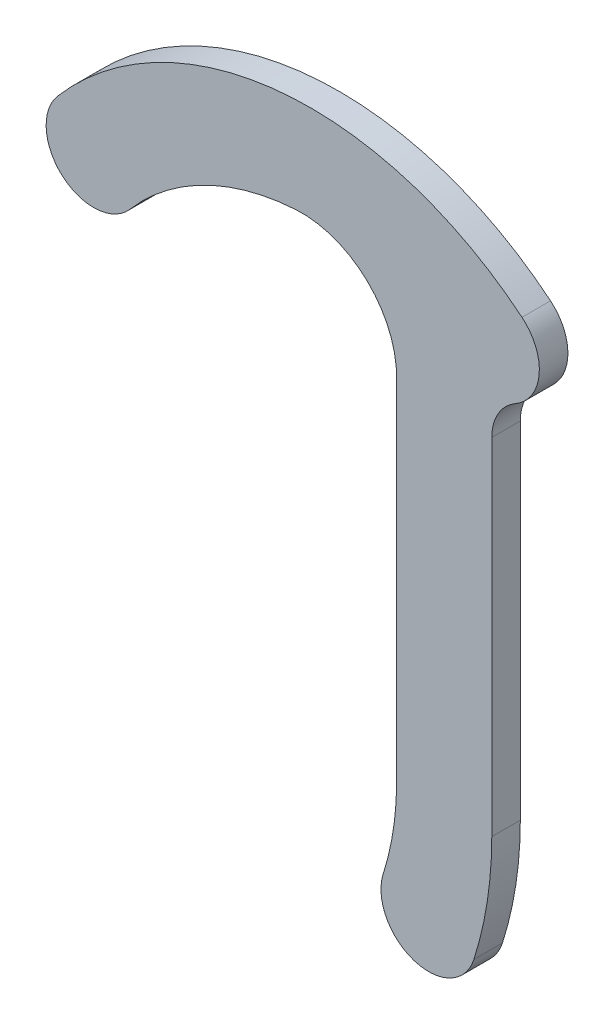
ISO-10303-21;
HEADER;
FILE_DESCRIPTION(('STEP AP214'),'2;1');
FILE_NAME('part.step','',(''),(''),'','','');
FILE_SCHEMA(('AUTOMOTIVE_DESIGN { 1 0 10303 214 1 1 1 1 }'));
ENDSEC;
DATA;
#1=APPLICATION_CONTEXT('core data for automotive mechanical design processes');
#2=APPLICATION_PROTOCOL_DEFINITION('international standard','automotive_design',2000,#1);
#3=PRODUCT_CONTEXT('',#1,'mechanical');
#4=PRODUCT('Part','Part','',(#3));
#5=PRODUCT_RELATED_PRODUCT_CATEGORY('part','',(#4));
#6=PRODUCT_DEFINITION_FORMATION('','',#4);
#7=PRODUCT_DEFINITION_CONTEXT('part definition',#1,'design');
#8=PRODUCT_DEFINITION('design','',#6,#7);
#9=PRODUCT_DEFINITION_SHAPE('','',#8);
#10=(LENGTH_UNIT() NAMED_UNIT(*) SI_UNIT(.MILLI.,.METRE.));
#11=(NAMED_UNIT(*) PLANE_ANGLE_UNIT() SI_UNIT($,.RADIAN.));
#12=(NAMED_UNIT(*) SI_UNIT($,.STERADIAN.) SOLID_ANGLE_UNIT());
#13=UNCERTAINTY_MEASURE_WITH_UNIT(LENGTH_MEASURE(1.E-05),#10,'distance_accuracy_value','');
#14=(GEOMETRIC_REPRESENTATION_CONTEXT(3) GLOBAL_UNCERTAINTY_ASSIGNED_CONTEXT((#13)) GLOBAL_UNIT_ASSIGNED_CONTEXT((#10,
#11,#12)) REPRESENTATION_CONTEXT('',''));
#15=CARTESIAN_POINT('',(0.,0.,0.));
#16=DIRECTION('',(0.,0.,1.));
#17=DIRECTION('',(1.,0.,0.));
#18=AXIS2_PLACEMENT_3D('',#15,#16,#17);
#19=CARTESIAN_POINT('',(-40.,-45.,1.5));
#20=DIRECTION('',(0.,0.,-1.));
#21=DIRECTION('',(-1.,0.,0.));
#22=AXIS2_PLACEMENT_3D('',#19,#20,#21);
#23=CYLINDRICAL_SURFACE('',#22,40.);
#24=CARTESIAN_POINT('',(-40.,-45.,-1.5));
#25=DIRECTION('',(0.,0.,1.));
#26=DIRECTION('',(-1.,0.,0.));
#27=AXIS2_PLACEMENT_3D('',#24,#25,#26);
#28=CIRCLE('',#27,40.);
#29=CARTESIAN_POINT('',(-1.88013713644046,-57.1192431803068,-1.5));
#30=VERTEX_POINT('',#29);
#31=CARTESIAN_POINT('',(0.,-44.9999999999999,-1.5));
#32=VERTEX_POINT('',#31);
#33=EDGE_CURVE('E211',#30,#32,#28,.T.);
#34=ORIENTED_EDGE('',*,*,#33,.T.);
#35=DIRECTION('',(0.,0.,-1.));
#36=VECTOR('',#35,1.);
#37=CARTESIAN_POINT('',(0.,-44.9999999999999,1.5));
#38=LINE('',#37,#36);
#39=CARTESIAN_POINT('',(0.,-44.9999999999999,1.5));
#40=VERTEX_POINT('',#39);
#41=EDGE_CURVE('E177',#40,#32,#38,.T.);
#42=ORIENTED_EDGE('',*,*,#41,.F.);
#43=CARTESIAN_POINT('',(-40.,-45.,1.5));
#44=DIRECTION('',(0.,0.,1.));
#45=DIRECTION('',(-1.,0.,0.));
#46=AXIS2_PLACEMENT_3D('',#43,#44,#45);
#47=CIRCLE('',#46,40.);
#48=CARTESIAN_POINT('',(-1.88013713644046,-57.1192431803068,1.5));
#49=VERTEX_POINT('',#48);
#50=EDGE_CURVE('E159',#49,#40,#47,.T.);
#51=ORIENTED_EDGE('',*,*,#50,.F.);
#52=DIRECTION('',(0.,0.,-1.));
#53=VECTOR('',#52,1.);
#54=CARTESIAN_POINT('',(-1.88013713644046,-57.1192431803068,1.5));
#55=LINE('',#54,#53);
#56=EDGE_CURVE('E160',#49,#30,#55,.T.);
#57=ORIENTED_EDGE('',*,*,#56,.T.);
#58=EDGE_LOOP('',(#34,#42,#51,#57));
#59=FACE_BOUND('',#58,.T.);
#60=ADVANCED_FACE('F32',(#59),#23,.T.);
#61=CARTESIAN_POINT('',(0.,-8.66025403784439,1.5));
#62=DIRECTION('',(-1.,0.,0.));
#63=DIRECTION('',(0.,-1.,0.));
#64=AXIS2_PLACEMENT_3D('',#61,#62,#63);
#65=PLANE('',#64);
#66=DIRECTION('',(0.,1.,0.));
#67=VECTOR('',#66,1.);
#68=CARTESIAN_POINT('',(0.,-8.66025403784439,-1.5));
#69=LINE('',#68,#67);
#70=CARTESIAN_POINT('',(0.,-8.66025403784439,-1.5));
#71=VERTEX_POINT('',#70);
#72=EDGE_CURVE('E150',#32,#71,#69,.T.);
#73=ORIENTED_EDGE('',*,*,#72,.T.);
#74=DIRECTION('',(0.,0.,-1.));
#75=VECTOR('',#74,1.);
#76=CARTESIAN_POINT('',(0.,-8.66025403784439,1.5));
#77=LINE('',#76,#75);
#78=CARTESIAN_POINT('',(0.,-8.66025403784439,1.5));
#79=VERTEX_POINT('',#78);
#80=EDGE_CURVE('E174',#79,#71,#77,.T.);
#81=ORIENTED_EDGE('',*,*,#80,.F.);
#82=DIRECTION('',(0.,1.,0.));
#83=VECTOR('',#82,1.);
#84=CARTESIAN_POINT('',(0.,-8.66025403784439,1.5));
#85=LINE('',#84,#83);
#86=EDGE_CURVE('E224',#40,#79,#85,.T.);
#87=ORIENTED_EDGE('',*,*,#86,.F.);
#88=ORIENTED_EDGE('',*,*,#41,.T.);
#89=EDGE_LOOP('',(#73,#81,#87,#88));
#90=FACE_BOUND('',#89,.T.);
#91=ADVANCED_FACE('F216',(#90),#65,.F.);
#92=CARTESIAN_POINT('',(5.,-8.66025403784439,1.5));
#93=DIRECTION('',(0.,0.,-1.));
#94=DIRECTION('',(-1.,0.,0.));
#95=AXIS2_PLACEMENT_3D('',#92,#93,#94);
#96=CYLINDRICAL_SURFACE('',#95,5.);
#97=CARTESIAN_POINT('',(5.,-8.66025403784439,-1.5));
#98=DIRECTION('',(0.,0.,-1.));
#99=DIRECTION('',(1.,0.,0.));
#100=AXIS2_PLACEMENT_3D('',#97,#98,#99);
#101=CIRCLE('',#100,5.);
#102=CARTESIAN_POINT('',(2.5,-4.33012701892219,-1.5));
#103=VERTEX_POINT('',#102);
#104=EDGE_CURVE('E146',#71,#103,#101,.T.);
#105=ORIENTED_EDGE('',*,*,#104,.T.);
#106=DIRECTION('',(0.,0.,-1.));
#107=VECTOR('',#106,1.);
#108=CARTESIAN_POINT('',(2.5,-4.33012701892219,1.5));
#109=LINE('',#108,#107);
#110=CARTESIAN_POINT('',(2.5,-4.33012701892219,1.5));
#111=VERTEX_POINT('',#110);
#112=EDGE_CURVE('E144',#111,#103,#109,.T.);
#113=ORIENTED_EDGE('',*,*,#112,.F.);
#114=CARTESIAN_POINT('',(5.,-8.66025403784439,1.5));
#115=DIRECTION('',(0.,0.,-1.));
#116=DIRECTION('',(1.,0.,0.));
#117=AXIS2_PLACEMENT_3D('',#114,#115,#116);
#118=CIRCLE('',#117,5.);
#119=EDGE_CURVE('E222',#79,#111,#118,.T.);
#120=ORIENTED_EDGE('',*,*,#119,.F.);
#121=ORIENTED_EDGE('',*,*,#80,.T.);
#122=EDGE_LOOP('',(#105,#113,#120,#121));
#123=FACE_BOUND('',#122,.T.);
#124=ADVANCED_FACE('F221',(#123),#96,.F.);
#125=CARTESIAN_POINT('',(0.,0.,1.5));
#126=DIRECTION('',(0.,0.,-1.));
#127=DIRECTION('',(-1.,0.,0.));
#128=AXIS2_PLACEMENT_3D('',#125,#126,#127);
#129=CYLINDRICAL_SURFACE('',#128,5.);
#130=CARTESIAN_POINT('',(0.,0.,-1.5));
#131=DIRECTION('',(0.,0.,1.));
#132=DIRECTION('',(-1.,0.,0.));
#133=AXIS2_PLACEMENT_3D('',#130,#131,#132);
#134=CIRCLE('',#133,5.);
#135=CARTESIAN_POINT('',(3.17547319383667,3.86217166827481,-1.5));
#136=VERTEX_POINT('',#135);
#137=EDGE_CURVE('E124',#103,#136,#134,.T.);
#138=ORIENTED_EDGE('',*,*,#137,.T.);
#139=DIRECTION('',(0.,0.,1.));
#140=VECTOR('',#139,1.);
#141=CARTESIAN_POINT('',(3.17547319383667,3.86217166827481,-57.2417446725537));
#142=LINE('',#141,#140);
#143=CARTESIAN_POINT('',(3.17547319383667,3.86217166827481,1.5));
#144=VERTEX_POINT('',#143);
#145=EDGE_CURVE('E130',#136,#144,#142,.T.);
#146=ORIENTED_EDGE('',*,*,#145,.T.);
#147=CARTESIAN_POINT('',(0.,0.,1.5));
#148=DIRECTION('',(0.,0.,1.));
#149=DIRECTION('',(-1.,0.,0.));
#150=AXIS2_PLACEMENT_3D('',#147,#148,#149);
#151=CIRCLE('',#150,5.);
#152=EDGE_CURVE('E223',#111,#144,#151,.T.);
#153=ORIENTED_EDGE('',*,*,#152,.F.);
#154=ORIENTED_EDGE('',*,*,#112,.T.);
#155=EDGE_LOOP('',(#138,#146,#153,#154));
#156=FACE_BOUND('',#155,.T.);
#157=ADVANCED_FACE('F142',(#156),#129,.T.);
#158=CARTESIAN_POINT('',(5.,-8.66025403784439,1.5));
#159=DIRECTION('',(0.,0.,-1.));
#160=DIRECTION('',(-1.,0.,0.));
#161=AXIS2_PLACEMENT_3D('',#158,#159,#160);
#162=CYLINDRICAL_SURFACE('',#161,15.);
#163=CARTESIAN_POINT('',(5.,-8.66025403784439,1.5));
#164=DIRECTION('',(0.,0.,1.));
#165=DIRECTION('',(1.,0.,0.));
#166=AXIS2_PLACEMENT_3D('',#163,#164,#165);
#167=CIRCLE('',#166,15.);
#168=CARTESIAN_POINT('',(-9.99748751363786,-8.38572120141778,1.5));
#169=VERTEX_POINT('',#168);
#170=CARTESIAN_POINT('',(-10.,-8.66025403784439,1.5));
#171=VERTEX_POINT('',#170);
#172=EDGE_CURVE('E188',#169,#171,#167,.T.);
#173=ORIENTED_EDGE('',*,*,#172,.F.);
#174=DIRECTION('',(0.,0.,-1.));
#175=VECTOR('',#174,1.);
#176=CARTESIAN_POINT('',(-9.99748751363786,-8.38572120141778,1.5));
#177=LINE('',#176,#175);
#178=CARTESIAN_POINT('',(-9.99748751363786,-8.38572120141778,-1.5));
#179=VERTEX_POINT('',#178);
#180=EDGE_CURVE('E180',#169,#179,#177,.T.);
#181=ORIENTED_EDGE('',*,*,#180,.T.);
#182=CARTESIAN_POINT('',(5.,-8.66025403784439,-1.5));
#183=DIRECTION('',(0.,0.,1.));
#184=DIRECTION('',(1.,0.,0.));
#185=AXIS2_PLACEMENT_3D('',#182,#183,#184);
#186=CIRCLE('',#185,15.);
#187=CARTESIAN_POINT('',(-10.,-8.66025403784439,-1.5));
#188=VERTEX_POINT('',#187);
#189=EDGE_CURVE('E145',#179,#188,#186,.T.);
#190=ORIENTED_EDGE('',*,*,#189,.T.);
#191=DIRECTION('',(0.,0.,-1.));
#192=VECTOR('',#191,1.);
#193=CARTESIAN_POINT('',(-10.,-8.66025403784439,1.5));
#194=LINE('',#193,#192);
#195=EDGE_CURVE('E170',#171,#188,#194,.T.);
#196=ORIENTED_EDGE('',*,*,#195,.F.);
#197=EDGE_LOOP('',(#173,#181,#190,#196));
#198=FACE_BOUND('',#197,.T.);
#199=ADVANCED_FACE('F186',(#198),#162,.T.);
#200=CARTESIAN_POINT('',(-10.,-45.,1.5));
#201=DIRECTION('',(1.,0.,0.));
#202=DIRECTION('',(0.,0.,-1.));
#203=AXIS2_PLACEMENT_3D('',#200,#201,#202);
#204=PLANE('',#203);
#205=DIRECTION('',(0.,-1.,0.));
#206=VECTOR('',#205,1.);
#207=CARTESIAN_POINT('',(-10.,-45.,-1.5));
#208=LINE('',#207,#206);
#209=CARTESIAN_POINT('',(-10.,-45.,-1.5));
#210=VERTEX_POINT('',#209);
#211=EDGE_CURVE('E148',#188,#210,#208,.T.);
#212=ORIENTED_EDGE('',*,*,#211,.T.);
#213=DIRECTION('',(0.,0.,-1.));
#214=VECTOR('',#213,1.);
#215=CARTESIAN_POINT('',(-10.,-45.,1.5));
#216=LINE('',#215,#214);
#217=CARTESIAN_POINT('',(-10.,-45.,1.5));
#218=VERTEX_POINT('',#217);
#219=EDGE_CURVE('E167',#218,#210,#216,.T.);
#220=ORIENTED_EDGE('',*,*,#219,.F.);
#221=DIRECTION('',(0.,-1.,0.));
#222=VECTOR('',#221,1.);
#223=CARTESIAN_POINT('',(-10.,-45.,1.5));
#224=LINE('',#223,#222);
#225=EDGE_CURVE('E205',#171,#218,#224,.T.);
#226=ORIENTED_EDGE('',*,*,#225,.F.);
#227=ORIENTED_EDGE('',*,*,#195,.T.);
#228=EDGE_LOOP('',(#212,#220,#226,#227));
#229=FACE_BOUND('',#228,.T.);
#230=ADVANCED_FACE('F196',(#229),#204,.F.);
#231=CARTESIAN_POINT('',(-40.,-45.,1.5));
#232=DIRECTION('',(0.,0.,-1.));
#233=DIRECTION('',(-1.,0.,0.));
#234=AXIS2_PLACEMENT_3D('',#231,#232,#233);
#235=CYLINDRICAL_SURFACE('',#234,30.);
#236=CARTESIAN_POINT('',(-40.,-45.,-1.5));
#237=DIRECTION('',(0.,0.,-1.));
#238=DIRECTION('',(-1.,0.,0.));
#239=AXIS2_PLACEMENT_3D('',#236,#237,#238);
#240=CIRCLE('',#239,30.);
#241=CARTESIAN_POINT('',(-11.4101028523303,-54.0894323852301,-1.5));
#242=VERTEX_POINT('',#241);
#243=EDGE_CURVE('E155',#210,#242,#240,.T.);
#244=ORIENTED_EDGE('',*,*,#243,.T.);
#245=DIRECTION('',(0.,0.,-1.));
#246=VECTOR('',#245,1.);
#247=CARTESIAN_POINT('',(-11.4101028523303,-54.0894323852301,1.5));
#248=LINE('',#247,#246);
#249=CARTESIAN_POINT('',(-11.4101028523303,-54.0894323852301,1.5));
#250=VERTEX_POINT('',#249);
#251=EDGE_CURVE('E163',#250,#242,#248,.T.);
#252=ORIENTED_EDGE('',*,*,#251,.F.);
#253=CARTESIAN_POINT('',(-40.,-45.,1.5));
#254=DIRECTION('',(0.,0.,-1.));
#255=DIRECTION('',(-1.,0.,0.));
#256=AXIS2_PLACEMENT_3D('',#253,#254,#255);
#257=CIRCLE('',#256,30.);
#258=EDGE_CURVE('E202',#218,#250,#257,.T.);
#259=ORIENTED_EDGE('',*,*,#258,.F.);
#260=ORIENTED_EDGE('',*,*,#219,.T.);
#261=EDGE_LOOP('',(#244,#252,#259,#260));
#262=FACE_BOUND('',#261,.T.);
#263=ADVANCED_FACE('F200',(#262),#235,.F.);
#264=CARTESIAN_POINT('',(-6.6451199943854,-55.6043377827685,1.5));
#265=DIRECTION('',(0.,0.,-1.));
#266=DIRECTION('',(-1.,0.,0.));
#267=AXIS2_PLACEMENT_3D('',#264,#265,#266);
#268=CYLINDRICAL_SURFACE('',#267,5.00000000000001);
#269=CARTESIAN_POINT('',(-6.6451199943854,-55.6043377827685,-1.5));
#270=DIRECTION('',(0.,0.,1.));
#271=DIRECTION('',(-1.,0.,0.));
#272=AXIS2_PLACEMENT_3D('',#269,#270,#271);
#273=CIRCLE('',#272,5.00000000000001);
#274=EDGE_CURVE('E157',#242,#30,#273,.T.);
#275=ORIENTED_EDGE('',*,*,#274,.T.);
#276=ORIENTED_EDGE('',*,*,#56,.F.);
#277=CARTESIAN_POINT('',(-6.6451199943854,-55.6043377827685,1.5));
#278=DIRECTION('',(0.,0.,1.));
#279=DIRECTION('',(-1.,0.,0.));
#280=AXIS2_PLACEMENT_3D('',#277,#278,#279);
#281=CIRCLE('',#280,5.00000000000001);
#282=EDGE_CURVE('E164',#250,#49,#281,.T.);
#283=ORIENTED_EDGE('',*,*,#282,.F.);
#284=ORIENTED_EDGE('',*,*,#251,.T.);
#285=EDGE_LOOP('',(#275,#276,#283,#284));
#286=FACE_BOUND('',#285,.T.);
#287=ADVANCED_FACE('F257',(#286),#268,.T.);
#288=CARTESIAN_POINT('',(-40.,-45.,1.5));
#289=DIRECTION('',(0.,0.,-1.));
#290=DIRECTION('',(-1.,0.,0.));
#291=AXIS2_PLACEMENT_3D('',#288,#289,#290);
#292=PLANE('',#291);
#293=ORIENTED_EDGE('',*,*,#119,.T.);
#294=ORIENTED_EDGE('',*,*,#152,.T.);
#295=CARTESIAN_POINT('',(-19.0528391630201,-23.1730300096489,1.5));
#296=DIRECTION('',(0.,0.,1.));
#297=DIRECTION('',(1.,0.,0.));
#298=AXIS2_PLACEMENT_3D('',#295,#296,#297);
#299=CIRCLE('',#298,35.);
#300=CARTESIAN_POINT('',(-45.6380670126589,-0.408459726360281,1.5));
#301=VERTEX_POINT('',#300);
#302=EDGE_CURVE('E135',#144,#301,#299,.T.);
#303=ORIENTED_EDGE('',*,*,#302,.T.);
#304=CARTESIAN_POINT('',(-41.8401773198533,-3.66054119540152,1.5));
#305=DIRECTION('',(0.,0.,1.));
#306=DIRECTION('',(-1.,0.,0.));
#307=AXIS2_PLACEMENT_3D('',#304,#305,#306);
#308=CIRCLE('',#307,5.);
#309=CARTESIAN_POINT('',(-38.0422876270478,-6.91262266444275,1.5));
#310=VERTEX_POINT('',#309);
#311=EDGE_CURVE('E139',#301,#310,#308,.T.);
#312=ORIENTED_EDGE('',*,*,#311,.T.);
#313=CARTESIAN_POINT('',(-19.0528391630201,-23.1730300096489,1.5));
#314=DIRECTION('',(0.,0.,-1.));
#315=DIRECTION('',(-1.,0.,0.));
#316=AXIS2_PLACEMENT_3D('',#313,#314,#315);
#317=CIRCLE('',#316,25.);
#318=CARTESIAN_POINT('',(-20.6244614292029,1.77752115565478,1.5));
#319=VERTEX_POINT('',#318);
#320=EDGE_CURVE('E231',#310,#319,#317,.T.);
#321=ORIENTED_EDGE('',*,*,#320,.T.);
#322=CARTESIAN_POINT('',(-19.9958125227298,-8.2026993104667,1.5));
#323=DIRECTION('',(0.,0.,-1.));
#324=DIRECTION('',(-1.,0.,0.));
#325=AXIS2_PLACEMENT_3D('',#322,#323,#324);
#326=CIRCLE('',#325,10.);
#327=EDGE_CURVE('E11',#319,#169,#326,.T.);
#328=ORIENTED_EDGE('',*,*,#327,.T.);
#329=ORIENTED_EDGE('',*,*,#172,.T.);
#330=ORIENTED_EDGE('',*,*,#225,.T.);
#331=ORIENTED_EDGE('',*,*,#258,.T.);
#332=ORIENTED_EDGE('',*,*,#282,.T.);
#333=ORIENTED_EDGE('',*,*,#50,.T.);
#334=ORIENTED_EDGE('',*,*,#86,.T.);
#335=EDGE_LOOP('',(#293,#294,#303,#312,#321,#328,#329,#330,#331,#332,#333,#334));
#336=FACE_BOUND('',#335,.T.);
#337=ADVANCED_FACE('F229',(#336),#292,.F.);
#338=CARTESIAN_POINT('',(-40.,-45.,-1.5));
#339=DIRECTION('',(0.,0.,-1.));
#340=DIRECTION('',(-1.,0.,0.));
#341=AXIS2_PLACEMENT_3D('',#338,#339,#340);
#342=PLANE('',#341);
#343=CARTESIAN_POINT('',(0.,0.,-1.5));
#344=DIRECTION('',(0.,0.,-1.));
#345=DIRECTION('',(-1.,0.,0.));
#346=AXIS2_PLACEMENT_3D('',#343,#344,#345);
#347=CIRCLE('',#346,2.5);
#348=CARTESIAN_POINT('',(-2.5,0.,-1.5));
#349=VERTEX_POINT('',#348);
#350=EDGE_CURVE('E285',#349,#349,#347,.T.);
#351=ORIENTED_EDGE('',*,*,#350,.F.);
#352=EDGE_LOOP('',(#351));
#353=FACE_BOUND('',#352,.T.);
#354=ORIENTED_EDGE('',*,*,#137,.F.);
#355=ORIENTED_EDGE('',*,*,#104,.F.);
#356=ORIENTED_EDGE('',*,*,#72,.F.);
#357=ORIENTED_EDGE('',*,*,#33,.F.);
#358=ORIENTED_EDGE('',*,*,#274,.F.);
#359=ORIENTED_EDGE('',*,*,#243,.F.);
#360=ORIENTED_EDGE('',*,*,#211,.F.);
#361=ORIENTED_EDGE('',*,*,#189,.F.);
#362=CARTESIAN_POINT('',(-19.9958125227298,-8.2026993104667,-1.5));
#363=DIRECTION('',(0.,0.,-1.));
#364=DIRECTION('',(-1.,0.,0.));
#365=AXIS2_PLACEMENT_3D('',#362,#363,#364);
#366=CIRCLE('',#365,10.);
#367=CARTESIAN_POINT('',(-20.6244614292029,1.77752115565478,-1.5));
#368=VERTEX_POINT('',#367);
#369=EDGE_CURVE('E40',#179,#368,#366,.F.);
#370=ORIENTED_EDGE('',*,*,#369,.T.);
#371=CARTESIAN_POINT('',(-19.0528391630201,-23.1730300096489,-1.5));
#372=DIRECTION('',(0.,0.,-1.));
#373=DIRECTION('',(-1.,0.,0.));
#374=AXIS2_PLACEMENT_3D('',#371,#372,#373);
#375=CIRCLE('',#374,25.);
#376=CARTESIAN_POINT('',(-38.0422876270478,-6.91262266444275,-1.5));
#377=VERTEX_POINT('',#376);
#378=EDGE_CURVE('E213',#377,#368,#375,.T.);
#379=ORIENTED_EDGE('',*,*,#378,.F.);
#380=CARTESIAN_POINT('',(-41.8401773198533,-3.66054119540152,-1.5));
#381=DIRECTION('',(0.,0.,-1.));
#382=DIRECTION('',(-1.,0.,0.));
#383=AXIS2_PLACEMENT_3D('',#380,#381,#382);
#384=CIRCLE('',#383,5.);
#385=CARTESIAN_POINT('',(-45.6380670126589,-0.408459726360277,-1.5));
#386=VERTEX_POINT('',#385);
#387=EDGE_CURVE('E126',#386,#377,#384,.F.);
#388=ORIENTED_EDGE('',*,*,#387,.F.);
#389=CARTESIAN_POINT('',(-19.0528391630201,-23.1730300096489,-1.5));
#390=DIRECTION('',(0.,0.,-1.));
#391=DIRECTION('',(-1.,0.,0.));
#392=AXIS2_PLACEMENT_3D('',#389,#390,#391);
#393=CIRCLE('',#392,35.);
#394=EDGE_CURVE('E119',#136,#386,#393,.F.);
#395=ORIENTED_EDGE('',*,*,#394,.F.);
#396=EDGE_LOOP('',(#354,#355,#356,#357,#358,#359,#360,#361,#370,#379,#388,#395));
#397=FACE_BOUND('',#396,.T.);
#398=ADVANCED_FACE('F121',(#353,#397),#342,.T.);
#399=CARTESIAN_POINT('',(-19.0528391630201,-23.1730300096489,-57.2417446725537));
#400=DIRECTION('',(0.,0.,1.));
#401=DIRECTION('',(1.,0.,0.));
#402=AXIS2_PLACEMENT_3D('',#399,#400,#401);
#403=CYLINDRICAL_SURFACE('',#402,25.);
#404=ORIENTED_EDGE('',*,*,#378,.T.);
#405=DIRECTION('',(0.,0.,1.));
#406=VECTOR('',#405,1.);
#407=CARTESIAN_POINT('',(-20.6244614292029,1.77752115565479,-57.2417446725537));
#408=LINE('',#407,#406);
#409=EDGE_CURVE('E53',#368,#319,#408,.T.);
#410=ORIENTED_EDGE('',*,*,#409,.T.);
#411=ORIENTED_EDGE('',*,*,#320,.F.);
#412=DIRECTION('',(0.,0.,1.));
#413=VECTOR('',#412,1.);
#414=CARTESIAN_POINT('',(-38.0422876270478,-6.91262266444275,-57.2417446725537));
#415=LINE('',#414,#413);
#416=EDGE_CURVE('E293',#377,#310,#415,.T.);
#417=ORIENTED_EDGE('',*,*,#416,.F.);
#418=EDGE_LOOP('',(#404,#410,#411,#417));
#419=FACE_BOUND('',#418,.T.);
#420=ADVANCED_FACE('F263',(#419),#403,.F.);
#421=CARTESIAN_POINT('',(-19.0528391630201,-23.1730300096489,-57.2417446725537));
#422=DIRECTION('',(0.,0.,1.));
#423=DIRECTION('',(1.,0.,0.));
#424=AXIS2_PLACEMENT_3D('',#421,#422,#423);
#425=CYLINDRICAL_SURFACE('',#424,35.);
#426=ORIENTED_EDGE('',*,*,#145,.F.);
#427=ORIENTED_EDGE('',*,*,#394,.T.);
#428=DIRECTION('',(0.,0.,1.));
#429=VECTOR('',#428,1.);
#430=CARTESIAN_POINT('',(-45.6380670126589,-0.408459726360281,-57.2417446725537));
#431=LINE('',#430,#429);
#432=EDGE_CURVE('E129',#386,#301,#431,.T.);
#433=ORIENTED_EDGE('',*,*,#432,.T.);
#434=ORIENTED_EDGE('',*,*,#302,.F.);
#435=EDGE_LOOP('',(#426,#427,#433,#434));
#436=FACE_BOUND('',#435,.T.);
#437=ADVANCED_FACE('F133',(#436),#425,.T.);
#438=CARTESIAN_POINT('',(-41.8401773198533,-3.66054119540152,-57.2417446725537));
#439=DIRECTION('',(0.,0.,1.));
#440=DIRECTION('',(1.,0.,0.));
#441=AXIS2_PLACEMENT_3D('',#438,#439,#440);
#442=CYLINDRICAL_SURFACE('',#441,5.);
#443=ORIENTED_EDGE('',*,*,#432,.F.);
#444=ORIENTED_EDGE('',*,*,#387,.T.);
#445=ORIENTED_EDGE('',*,*,#416,.T.);
#446=ORIENTED_EDGE('',*,*,#311,.F.);
#447=EDGE_LOOP('',(#443,#444,#445,#446));
#448=FACE_BOUND('',#447,.T.);
#449=ADVANCED_FACE('F269',(#448),#442,.T.);
#450=CARTESIAN_POINT('',(0.,0.,0.5));
#451=DIRECTION('',(0.,0.,-1.));
#452=DIRECTION('',(-1.,0.,0.));
#453=AXIS2_PLACEMENT_3D('',#450,#451,#452);
#454=CYLINDRICAL_SURFACE('',#453,2.5);
#455=CARTESIAN_POINT('',(0.,0.,0.5));
#456=DIRECTION('',(0.,0.,-1.));
#457=DIRECTION('',(-1.,0.,0.));
#458=AXIS2_PLACEMENT_3D('',#455,#456,#457);
#459=CIRCLE('',#458,2.5);
#460=CARTESIAN_POINT('',(-2.5,0.,0.5));
#461=VERTEX_POINT('',#460);
#462=EDGE_CURVE('E282',#461,#461,#459,.T.);
#463=ORIENTED_EDGE('',*,*,#462,.F.);
#464=EDGE_LOOP('',(#463));
#465=FACE_BOUND('',#464,.T.);
#466=ORIENTED_EDGE('',*,*,#350,.T.);
#467=EDGE_LOOP('',(#466));
#468=FACE_BOUND('',#467,.T.);
#469=ADVANCED_FACE('F237',(#465,#468),#454,.F.);
#470=CARTESIAN_POINT('',(0.,0.,0.5));
#471=DIRECTION('',(0.,0.,-1.));
#472=DIRECTION('',(-1.,0.,0.));
#473=AXIS2_PLACEMENT_3D('',#470,#471,#472);
#474=PLANE('',#473);
#475=ORIENTED_EDGE('',*,*,#462,.T.);
#476=EDGE_LOOP('',(#475));
#477=FACE_BOUND('',#476,.T.);
#478=ADVANCED_FACE('F233',(#477),#474,.T.);
#479=CARTESIAN_POINT('',(-19.9958125227298,-8.2026993104667,-57.2417446725537));
#480=DIRECTION('',(0.,0.,-1.));
#481=DIRECTION('',(-1.,0.,0.));
#482=AXIS2_PLACEMENT_3D('',#479,#480,#481);
#483=CYLINDRICAL_SURFACE('',#482,10.);
#484=ORIENTED_EDGE('',*,*,#327,.F.);
#485=ORIENTED_EDGE('',*,*,#409,.F.);
#486=ORIENTED_EDGE('',*,*,#369,.F.);
#487=ORIENTED_EDGE('',*,*,#180,.F.);
#488=EDGE_LOOP('',(#484,#485,#486,#487));
#489=FACE_BOUND('',#488,.T.);
#490=ADVANCED_FACE('F34',(#489),#483,.F.);
#491=CLOSED_SHELL('',(#60,#91,#124,#157,#199,#230,#263,#287,#337,#398,#420,#437,#449,#469,#478,#490));
#492=MANIFOLD_SOLID_BREP('B2',#491);
#493=ADVANCED_BREP_SHAPE_REPRESENTATION('',(#18,#492),#14);
#494=SHAPE_DEFINITION_REPRESENTATION(#9,#493);
ENDSEC;
END-ISO-10303-21;
